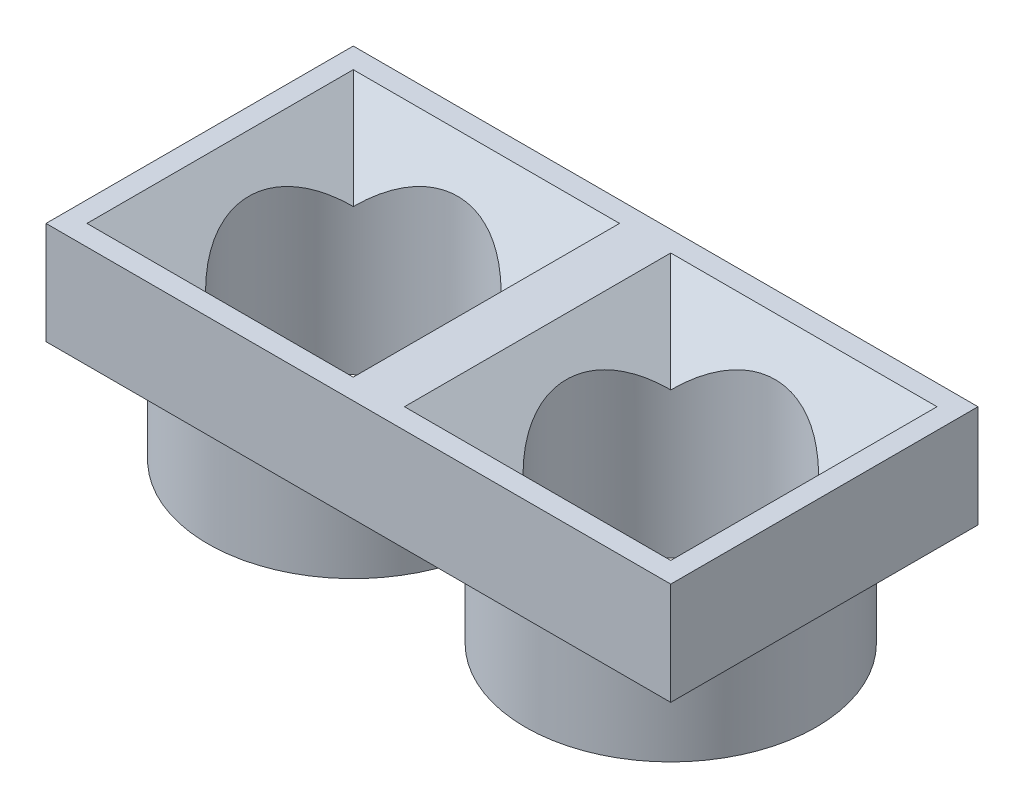
ISO-10303-21;
HEADER;
FILE_DESCRIPTION(('STEP AP214'),'2;1');
FILE_NAME('part.step','',(''),(''),'','','');
FILE_SCHEMA(('AUTOMOTIVE_DESIGN { 1 0 10303 214 1 1 1 1 }'));
ENDSEC;
DATA;
#1=APPLICATION_CONTEXT('core data for automotive mechanical design processes');
#2=APPLICATION_PROTOCOL_DEFINITION('international standard','automotive_design',2000,#1);
#3=PRODUCT_CONTEXT('',#1,'mechanical');
#4=PRODUCT('Part','Part','',(#3));
#5=PRODUCT_RELATED_PRODUCT_CATEGORY('part','',(#4));
#6=PRODUCT_DEFINITION_FORMATION('','',#4);
#7=PRODUCT_DEFINITION_CONTEXT('part definition',#1,'design');
#8=PRODUCT_DEFINITION('design','',#6,#7);
#9=PRODUCT_DEFINITION_SHAPE('','',#8);
#10=(LENGTH_UNIT() NAMED_UNIT(*) SI_UNIT(.MILLI.,.METRE.));
#11=(NAMED_UNIT(*) PLANE_ANGLE_UNIT() SI_UNIT($,.RADIAN.));
#12=(NAMED_UNIT(*) SI_UNIT($,.STERADIAN.) SOLID_ANGLE_UNIT());
#13=UNCERTAINTY_MEASURE_WITH_UNIT(LENGTH_MEASURE(1.E-05),#10,'distance_accuracy_value','');
#14=(GEOMETRIC_REPRESENTATION_CONTEXT(3) GLOBAL_UNCERTAINTY_ASSIGNED_CONTEXT((#13)) GLOBAL_UNIT_ASSIGNED_CONTEXT((#10,
#11,#12)) REPRESENTATION_CONTEXT('',''));
#15=CARTESIAN_POINT('',(0.,0.,0.));
#16=DIRECTION('',(0.,0.,1.));
#17=DIRECTION('',(1.,0.,0.));
#18=AXIS2_PLACEMENT_3D('',#15,#16,#17);
#19=CARTESIAN_POINT('',(0.,0.,0.));
#20=DIRECTION('',(0.,1.,0.));
#21=DIRECTION('',(0.,0.,1.));
#22=AXIS2_PLACEMENT_3D('',#19,#20,#21);
#23=PLANE('',#22);
#24=DIRECTION('',(0.,0.,-1.));
#25=VECTOR('',#24,1.);
#26=CARTESIAN_POINT('',(15.25,0.,-7.5));
#27=LINE('',#26,#25);
#28=CARTESIAN_POINT('',(15.25,0.,7.5));
#29=VERTEX_POINT('',#28);
#30=CARTESIAN_POINT('',(15.25,0.,-7.5));
#31=VERTEX_POINT('',#30);
#32=EDGE_CURVE('E214',#29,#31,#27,.T.);
#33=ORIENTED_EDGE('',*,*,#32,.F.);
#34=DIRECTION('',(1.,0.,0.));
#35=VECTOR('',#34,1.);
#36=CARTESIAN_POINT('',(-15.25,0.,7.5));
#37=LINE('',#36,#35);
#38=CARTESIAN_POINT('',(-15.25,0.,7.5));
#39=VERTEX_POINT('',#38);
#40=EDGE_CURVE('E233',#39,#29,#37,.T.);
#41=ORIENTED_EDGE('',*,*,#40,.F.);
#42=DIRECTION('',(0.,0.,1.));
#43=VECTOR('',#42,1.);
#44=CARTESIAN_POINT('',(-15.25,0.,-7.5));
#45=LINE('',#44,#43);
#46=CARTESIAN_POINT('',(-15.25,0.,-7.5));
#47=VERTEX_POINT('',#46);
#48=EDGE_CURVE('E249',#47,#39,#45,.T.);
#49=ORIENTED_EDGE('',*,*,#48,.F.);
#50=DIRECTION('',(-1.,0.,0.));
#51=VECTOR('',#50,1.);
#52=CARTESIAN_POINT('',(-15.25,0.,-7.5));
#53=LINE('',#52,#51);
#54=EDGE_CURVE('E246',#31,#47,#53,.T.);
#55=ORIENTED_EDGE('',*,*,#54,.F.);
#56=EDGE_LOOP('',(#33,#41,#49,#55));
#57=FACE_BOUND('',#56,.T.);
#58=CARTESIAN_POINT('',(-7.75,0.,0.));
#59=DIRECTION('',(0.,-1.,0.));
#60=DIRECTION('',(0.,0.,-1.));
#61=AXIS2_PLACEMENT_3D('',#58,#59,#60);
#62=CIRCLE('',#61,7.1);
#63=CARTESIAN_POINT('',(-7.75,0.,-7.1));
#64=VERTEX_POINT('',#63);
#65=EDGE_CURVE('E51',#64,#64,#62,.T.);
#66=ORIENTED_EDGE('',*,*,#65,.F.);
#67=EDGE_LOOP('',(#66));
#68=FACE_BOUND('',#67,.T.);
#69=CARTESIAN_POINT('',(7.75,0.,0.));
#70=DIRECTION('',(0.,1.,0.));
#71=DIRECTION('',(0.,0.,1.));
#72=AXIS2_PLACEMENT_3D('',#69,#70,#71);
#73=CIRCLE('',#72,7.1);
#74=CARTESIAN_POINT('',(7.75,0.,7.1));
#75=VERTEX_POINT('',#74);
#76=EDGE_CURVE('E11',#75,#75,#73,.F.);
#77=ORIENTED_EDGE('',*,*,#76,.F.);
#78=EDGE_LOOP('',(#77));
#79=FACE_BOUND('',#78,.T.);
#80=ADVANCED_FACE('F41',(#57,#68,#79),#23,.F.);
#81=CARTESIAN_POINT('',(15.25,5.,-7.5));
#82=DIRECTION('',(-1.,0.,0.));
#83=DIRECTION('',(0.,0.,1.));
#84=AXIS2_PLACEMENT_3D('',#81,#82,#83);
#85=PLANE('',#84);
#86=ORIENTED_EDGE('',*,*,#32,.T.);
#87=DIRECTION('',(0.,-1.,0.));
#88=VECTOR('',#87,1.);
#89=CARTESIAN_POINT('',(15.25,5.,-7.5));
#90=LINE('',#89,#88);
#91=CARTESIAN_POINT('',(15.25,5.,-7.5));
#92=VERTEX_POINT('',#91);
#93=EDGE_CURVE('E140',#92,#31,#90,.T.);
#94=ORIENTED_EDGE('',*,*,#93,.F.);
#95=DIRECTION('',(0.,0.,-1.));
#96=VECTOR('',#95,1.);
#97=CARTESIAN_POINT('',(15.25,5.,-7.5));
#98=LINE('',#97,#96);
#99=CARTESIAN_POINT('',(15.25,5.,7.5));
#100=VERTEX_POINT('',#99);
#101=EDGE_CURVE('E228',#100,#92,#98,.T.);
#102=ORIENTED_EDGE('',*,*,#101,.F.);
#103=DIRECTION('',(0.,-1.,0.));
#104=VECTOR('',#103,1.);
#105=CARTESIAN_POINT('',(15.25,5.,7.5));
#106=LINE('',#105,#104);
#107=EDGE_CURVE('E242',#100,#29,#106,.T.);
#108=ORIENTED_EDGE('',*,*,#107,.T.);
#109=EDGE_LOOP('',(#86,#94,#102,#108));
#110=FACE_BOUND('',#109,.T.);
#111=ADVANCED_FACE('F303',(#110),#85,.F.);
#112=CARTESIAN_POINT('',(-15.25,5.,-7.5));
#113=DIRECTION('',(0.,0.,1.));
#114=DIRECTION('',(1.,0.,0.));
#115=AXIS2_PLACEMENT_3D('',#112,#113,#114);
#116=PLANE('',#115);
#117=ORIENTED_EDGE('',*,*,#54,.T.);
#118=DIRECTION('',(0.,-1.,0.));
#119=VECTOR('',#118,1.);
#120=CARTESIAN_POINT('',(-15.25,5.,-7.5));
#121=LINE('',#120,#119);
#122=CARTESIAN_POINT('',(-15.25,5.,-7.5));
#123=VERTEX_POINT('',#122);
#124=EDGE_CURVE('E261',#123,#47,#121,.T.);
#125=ORIENTED_EDGE('',*,*,#124,.F.);
#126=DIRECTION('',(-1.,0.,0.));
#127=VECTOR('',#126,1.);
#128=CARTESIAN_POINT('',(-15.25,5.,-7.5));
#129=LINE('',#128,#127);
#130=EDGE_CURVE('E232',#92,#123,#129,.T.);
#131=ORIENTED_EDGE('',*,*,#130,.F.);
#132=ORIENTED_EDGE('',*,*,#93,.T.);
#133=EDGE_LOOP('',(#117,#125,#131,#132));
#134=FACE_BOUND('',#133,.T.);
#135=ADVANCED_FACE('F309',(#134),#116,.F.);
#136=CARTESIAN_POINT('',(-15.25,5.,-7.5));
#137=DIRECTION('',(1.,0.,0.));
#138=DIRECTION('',(0.,0.,-1.));
#139=AXIS2_PLACEMENT_3D('',#136,#137,#138);
#140=PLANE('',#139);
#141=ORIENTED_EDGE('',*,*,#48,.T.);
#142=DIRECTION('',(0.,-1.,0.));
#143=VECTOR('',#142,1.);
#144=CARTESIAN_POINT('',(-15.25,5.,7.5));
#145=LINE('',#144,#143);
#146=CARTESIAN_POINT('',(-15.25,5.,7.5));
#147=VERTEX_POINT('',#146);
#148=EDGE_CURVE('E257',#147,#39,#145,.T.);
#149=ORIENTED_EDGE('',*,*,#148,.F.);
#150=DIRECTION('',(0.,0.,1.));
#151=VECTOR('',#150,1.);
#152=CARTESIAN_POINT('',(-15.25,5.,-7.5));
#153=LINE('',#152,#151);
#154=EDGE_CURVE('E236',#123,#147,#153,.T.);
#155=ORIENTED_EDGE('',*,*,#154,.F.);
#156=ORIENTED_EDGE('',*,*,#124,.T.);
#157=EDGE_LOOP('',(#141,#149,#155,#156));
#158=FACE_BOUND('',#157,.T.);
#159=ADVANCED_FACE('F319',(#158),#140,.F.);
#160=CARTESIAN_POINT('',(-15.25,5.,7.5));
#161=DIRECTION('',(0.,0.,-1.));
#162=DIRECTION('',(-1.,0.,0.));
#163=AXIS2_PLACEMENT_3D('',#160,#161,#162);
#164=PLANE('',#163);
#165=ORIENTED_EDGE('',*,*,#40,.T.);
#166=ORIENTED_EDGE('',*,*,#107,.F.);
#167=DIRECTION('',(1.,0.,0.));
#168=VECTOR('',#167,1.);
#169=CARTESIAN_POINT('',(-15.25,5.,7.5));
#170=LINE('',#169,#168);
#171=EDGE_CURVE('E239',#147,#100,#170,.T.);
#172=ORIENTED_EDGE('',*,*,#171,.F.);
#173=ORIENTED_EDGE('',*,*,#148,.T.);
#174=EDGE_LOOP('',(#165,#166,#172,#173));
#175=FACE_BOUND('',#174,.T.);
#176=ADVANCED_FACE('F316',(#175),#164,.F.);
#177=CARTESIAN_POINT('',(0.,5.,0.));
#178=DIRECTION('',(0.,1.,0.));
#179=DIRECTION('',(0.,0.,1.));
#180=AXIS2_PLACEMENT_3D('',#177,#178,#179);
#181=PLANE('',#180);
#182=DIRECTION('',(0.,0.,1.));
#183=VECTOR('',#182,1.);
#184=CARTESIAN_POINT('',(-14.25,5.,-6.5));
#185=LINE('',#184,#183);
#186=CARTESIAN_POINT('',(-14.25,5.,-6.5));
#187=VERTEX_POINT('',#186);
#188=CARTESIAN_POINT('',(-14.25,5.,6.5));
#189=VERTEX_POINT('',#188);
#190=EDGE_CURVE('E198',#187,#189,#185,.T.);
#191=ORIENTED_EDGE('',*,*,#190,.F.);
#192=DIRECTION('',(-1.,0.,0.));
#193=VECTOR('',#192,1.);
#194=CARTESIAN_POINT('',(-14.25,5.,-6.5));
#195=LINE('',#194,#193);
#196=CARTESIAN_POINT('',(-1.25,5.,-6.5));
#197=VERTEX_POINT('',#196);
#198=EDGE_CURVE('E210',#197,#187,#195,.T.);
#199=ORIENTED_EDGE('',*,*,#198,.F.);
#200=DIRECTION('',(0.,0.,-1.));
#201=VECTOR('',#200,1.);
#202=CARTESIAN_POINT('',(-1.25,5.,-6.5));
#203=LINE('',#202,#201);
#204=CARTESIAN_POINT('',(-1.25,5.,6.5));
#205=VERTEX_POINT('',#204);
#206=EDGE_CURVE('E206',#205,#197,#203,.T.);
#207=ORIENTED_EDGE('',*,*,#206,.F.);
#208=DIRECTION('',(1.,0.,0.));
#209=VECTOR('',#208,1.);
#210=CARTESIAN_POINT('',(-14.25,5.,6.5));
#211=LINE('',#210,#209);
#212=EDGE_CURVE('E202',#189,#205,#211,.T.);
#213=ORIENTED_EDGE('',*,*,#212,.F.);
#214=EDGE_LOOP('',(#191,#199,#207,#213));
#215=FACE_BOUND('',#214,.T.);
#216=DIRECTION('',(0.,0.,1.));
#217=VECTOR('',#216,1.);
#218=CARTESIAN_POINT('',(1.25,5.,-6.5));
#219=LINE('',#218,#217);
#220=CARTESIAN_POINT('',(1.25,5.,-6.5));
#221=VERTEX_POINT('',#220);
#222=CARTESIAN_POINT('',(1.25,5.,6.5));
#223=VERTEX_POINT('',#222);
#224=EDGE_CURVE('E215',#221,#223,#219,.T.);
#225=ORIENTED_EDGE('',*,*,#224,.F.);
#226=DIRECTION('',(-1.,0.,0.));
#227=VECTOR('',#226,1.);
#228=CARTESIAN_POINT('',(1.25,5.,-6.5));
#229=LINE('',#228,#227);
#230=CARTESIAN_POINT('',(14.25,5.,-6.5));
#231=VERTEX_POINT('',#230);
#232=EDGE_CURVE('E156',#231,#221,#229,.T.);
#233=ORIENTED_EDGE('',*,*,#232,.F.);
#234=DIRECTION('',(0.,0.,-1.));
#235=VECTOR('',#234,1.);
#236=CARTESIAN_POINT('',(14.25,5.,-6.5));
#237=LINE('',#236,#235);
#238=CARTESIAN_POINT('',(14.25,5.,6.5));
#239=VERTEX_POINT('',#238);
#240=EDGE_CURVE('E222',#239,#231,#237,.T.);
#241=ORIENTED_EDGE('',*,*,#240,.F.);
#242=DIRECTION('',(1.,0.,0.));
#243=VECTOR('',#242,1.);
#244=CARTESIAN_POINT('',(1.25,5.,6.5));
#245=LINE('',#244,#243);
#246=EDGE_CURVE('E218',#223,#239,#245,.T.);
#247=ORIENTED_EDGE('',*,*,#246,.F.);
#248=EDGE_LOOP('',(#225,#233,#241,#247));
#249=FACE_BOUND('',#248,.T.);
#250=ORIENTED_EDGE('',*,*,#101,.T.);
#251=ORIENTED_EDGE('',*,*,#130,.T.);
#252=ORIENTED_EDGE('',*,*,#154,.T.);
#253=ORIENTED_EDGE('',*,*,#171,.T.);
#254=EDGE_LOOP('',(#250,#251,#252,#253));
#255=FACE_BOUND('',#254,.T.);
#256=ADVANCED_FACE('F285',(#215,#249,#255),#181,.T.);
#257=CARTESIAN_POINT('',(0.,2.,3.49999999999998));
#258=DIRECTION('',(0.,-0.707106781186551,0.707106781186544));
#259=DIRECTION('',(1.,0.,0.));
#260=AXIS2_PLACEMENT_3D('',#257,#258,#259);
#261=PLANE('',#260);
#262=DIRECTION('',(-0.577350269189628,-0.577350269189622,-0.577350269189628));
#263=VECTOR('',#262,1.);
#264=CARTESIAN_POINT('',(-5.41666666666669,0.833333333333345,2.33333333333331));
#265=LINE('',#264,#263);
#266=CARTESIAN_POINT('',(-4.14375541594861,2.10624458405141,3.60624458405139));
#267=VERTEX_POINT('',#266);
#268=EDGE_CURVE('E167',#267,#205,#265,.F.);
#269=ORIENTED_EDGE('',*,*,#268,.F.);
#270=CARTESIAN_POINT('',(-7.75,-1.49999999999994,0.));
#271=DIRECTION('',(0.,-0.707106781186551,0.707106781186544));
#272=DIRECTION('',(0.,0.707106781186544,0.707106781186551));
#273=AXIS2_PLACEMENT_3D('',#270,#271,#272);
#274=ELLIPSE('',#273,7.21248916810275,5.1);
#275=CARTESIAN_POINT('',(-11.3562445840514,2.10624458405141,3.60624458405139));
#276=VERTEX_POINT('',#275);
#277=EDGE_CURVE('E159',#267,#276,#274,.T.);
#278=ORIENTED_EDGE('',*,*,#277,.T.);
#279=DIRECTION('',(0.577350269189628,-0.577350269189622,-0.577350269189628));
#280=VECTOR('',#279,1.);
#281=CARTESIAN_POINT('',(-7.49999999999996,-1.74999999999998,-0.250000000000041));
#282=LINE('',#281,#280);
#283=EDGE_CURVE('E272',#189,#276,#282,.T.);
#284=ORIENTED_EDGE('',*,*,#283,.F.);
#285=ORIENTED_EDGE('',*,*,#212,.T.);
#286=EDGE_LOOP('',(#269,#278,#284,#285));
#287=FACE_BOUND('',#286,.T.);
#288=ADVANCED_FACE('F287',(#287),#261,.F.);
#289=CARTESIAN_POINT('',(-4.25000000000002,2.,0.));
#290=DIRECTION('',(0.707106781186544,-0.707106781186551,0.));
#291=DIRECTION('',(0.,0.,-1.));
#292=AXIS2_PLACEMENT_3D('',#289,#290,#291);
#293=PLANE('',#292);
#294=DIRECTION('',(-0.577350269189628,-0.577350269189622,0.577350269189628));
#295=VECTOR('',#294,1.);
#296=CARTESIAN_POINT('',(-2.83333333333334,3.41666666666667,-4.91666666666666));
#297=LINE('',#296,#295);
#298=CARTESIAN_POINT('',(-4.14375541594861,2.10624458405141,-3.60624458405139));
#299=VERTEX_POINT('',#298);
#300=EDGE_CURVE('E270',#299,#197,#297,.F.);
#301=ORIENTED_EDGE('',*,*,#300,.F.);
#302=CARTESIAN_POINT('',(-7.75,-1.49999999999995,0.));
#303=DIRECTION('',(0.707106781186544,-0.707106781186551,0.));
#304=DIRECTION('',(0.707106781186551,0.707106781186544,0.));
#305=AXIS2_PLACEMENT_3D('',#302,#303,#304);
#306=ELLIPSE('',#305,7.21248916810275,5.1);
#307=EDGE_CURVE('E58',#299,#267,#306,.T.);
#308=ORIENTED_EDGE('',*,*,#307,.T.);
#309=ORIENTED_EDGE('',*,*,#268,.T.);
#310=ORIENTED_EDGE('',*,*,#206,.T.);
#311=EDGE_LOOP('',(#301,#308,#309,#310));
#312=FACE_BOUND('',#311,.T.);
#313=ADVANCED_FACE('F281',(#312),#293,.F.);
#314=CARTESIAN_POINT('',(-11.25,2.,0.));
#315=DIRECTION('',(-0.707106781186544,-0.707106781186551,0.));
#316=DIRECTION('',(0.,0.,1.));
#317=AXIS2_PLACEMENT_3D('',#314,#315,#316);
#318=PLANE('',#317);
#319=ORIENTED_EDGE('',*,*,#283,.T.);
#320=CARTESIAN_POINT('',(-7.75,-1.49999999999994,0.));
#321=DIRECTION('',(-0.707106781186544,-0.707106781186551,0.));
#322=DIRECTION('',(-0.707106781186551,0.707106781186544,0.));
#323=AXIS2_PLACEMENT_3D('',#320,#321,#322);
#324=ELLIPSE('',#323,7.21248916810275,5.1);
#325=CARTESIAN_POINT('',(-11.3562445840514,2.10624458405141,-3.60624458405139));
#326=VERTEX_POINT('',#325);
#327=EDGE_CURVE('E192',#276,#326,#324,.T.);
#328=ORIENTED_EDGE('',*,*,#327,.T.);
#329=DIRECTION('',(-0.577350269189628,0.577350269189622,-0.577350269189628));
#330=VECTOR('',#329,1.);
#331=CARTESIAN_POINT('',(-7.49999999999996,-1.74999999999998,0.25000000000004));
#332=LINE('',#331,#330);
#333=EDGE_CURVE('E174',#187,#326,#332,.F.);
#334=ORIENTED_EDGE('',*,*,#333,.F.);
#335=ORIENTED_EDGE('',*,*,#190,.T.);
#336=EDGE_LOOP('',(#319,#328,#334,#335));
#337=FACE_BOUND('',#336,.T.);
#338=ADVANCED_FACE('F289',(#337),#318,.F.);
#339=CARTESIAN_POINT('',(0.,2.,-3.49999999999998));
#340=DIRECTION('',(0.,-0.707106781186551,-0.707106781186544));
#341=DIRECTION('',(-1.,0.,0.));
#342=AXIS2_PLACEMENT_3D('',#339,#340,#341);
#343=PLANE('',#342);
#344=ORIENTED_EDGE('',*,*,#333,.T.);
#345=CARTESIAN_POINT('',(-7.75,-1.49999999999994,0.));
#346=DIRECTION('',(0.,-0.707106781186551,-0.707106781186544));
#347=DIRECTION('',(0.,0.707106781186544,-0.707106781186551));
#348=AXIS2_PLACEMENT_3D('',#345,#346,#347);
#349=ELLIPSE('',#348,7.21248916810275,5.1);
#350=EDGE_CURVE('E139',#326,#299,#349,.T.);
#351=ORIENTED_EDGE('',*,*,#350,.T.);
#352=ORIENTED_EDGE('',*,*,#300,.T.);
#353=ORIENTED_EDGE('',*,*,#198,.T.);
#354=EDGE_LOOP('',(#344,#351,#352,#353));
#355=FACE_BOUND('',#354,.T.);
#356=ADVANCED_FACE('F290',(#355),#343,.F.);
#357=CARTESIAN_POINT('',(0.,2.,3.49999999999997));
#358=DIRECTION('',(0.,-0.707106781186551,0.707106781186544));
#359=DIRECTION('',(1.,0.,0.));
#360=AXIS2_PLACEMENT_3D('',#357,#358,#359);
#361=PLANE('',#360);
#362=DIRECTION('',(-0.577350269189628,-0.577350269189622,-0.577350269189628));
#363=VECTOR('',#362,1.);
#364=CARTESIAN_POINT('',(10.0833333333333,0.833333333333348,2.3333333333333));
#365=LINE('',#364,#363);
#366=CARTESIAN_POINT('',(11.3562445840514,2.10624458405142,3.60624458405139));
#367=VERTEX_POINT('',#366);
#368=EDGE_CURVE('E172',#367,#239,#365,.F.);
#369=ORIENTED_EDGE('',*,*,#368,.F.);
#370=CARTESIAN_POINT('',(7.75,-1.49999999999993,0.));
#371=DIRECTION('',(0.,-0.707106781186551,0.707106781186544));
#372=DIRECTION('',(0.,0.707106781186544,0.707106781186551));
#373=AXIS2_PLACEMENT_3D('',#370,#371,#372);
#374=ELLIPSE('',#373,7.21248916810275,5.1);
#375=CARTESIAN_POINT('',(4.14375541594861,2.10624458405143,3.60624458405139));
#376=VERTEX_POINT('',#375);
#377=EDGE_CURVE('E189',#367,#376,#374,.T.);
#378=ORIENTED_EDGE('',*,*,#377,.T.);
#379=DIRECTION('',(0.577350269189628,-0.577350269189622,-0.577350269189628));
#380=VECTOR('',#379,1.);
#381=CARTESIAN_POINT('',(2.83333333333335,3.41666666666667,4.91666666666666));
#382=LINE('',#381,#380);
#383=EDGE_CURVE('E149',#223,#376,#382,.T.);
#384=ORIENTED_EDGE('',*,*,#383,.F.);
#385=ORIENTED_EDGE('',*,*,#246,.T.);
#386=EDGE_LOOP('',(#369,#378,#384,#385));
#387=FACE_BOUND('',#386,.T.);
#388=ADVANCED_FACE('F44',(#387),#361,.F.);
#389=CARTESIAN_POINT('',(11.25,2.,0.));
#390=DIRECTION('',(0.707106781186544,-0.707106781186551,0.));
#391=DIRECTION('',(0.,0.,-1.));
#392=AXIS2_PLACEMENT_3D('',#389,#390,#391);
#393=PLANE('',#392);
#394=DIRECTION('',(-0.577350269189628,-0.577350269189622,0.577350269189628));
#395=VECTOR('',#394,1.);
#396=CARTESIAN_POINT('',(7.49999999999995,-1.74999999999998,0.250000000000048));
#397=LINE('',#396,#395);
#398=CARTESIAN_POINT('',(11.3562445840514,2.10624458405142,-3.60624458405139));
#399=VERTEX_POINT('',#398);
#400=EDGE_CURVE('E158',#399,#231,#397,.F.);
#401=ORIENTED_EDGE('',*,*,#400,.F.);
#402=CARTESIAN_POINT('',(7.75,-1.49999999999993,0.));
#403=DIRECTION('',(0.707106781186544,-0.707106781186551,0.));
#404=DIRECTION('',(0.707106781186551,0.707106781186544,0.));
#405=AXIS2_PLACEMENT_3D('',#402,#403,#404);
#406=ELLIPSE('',#405,7.21248916810275,5.1);
#407=EDGE_CURVE('E66',#399,#367,#406,.T.);
#408=ORIENTED_EDGE('',*,*,#407,.T.);
#409=ORIENTED_EDGE('',*,*,#368,.T.);
#410=ORIENTED_EDGE('',*,*,#240,.T.);
#411=EDGE_LOOP('',(#401,#408,#409,#410));
#412=FACE_BOUND('',#411,.T.);
#413=ADVANCED_FACE('F297',(#412),#393,.F.);
#414=CARTESIAN_POINT('',(4.25000000000003,2.,0.));
#415=DIRECTION('',(-0.707106781186544,-0.707106781186551,0.));
#416=DIRECTION('',(0.,0.,1.));
#417=AXIS2_PLACEMENT_3D('',#414,#415,#416);
#418=PLANE('',#417);
#419=ORIENTED_EDGE('',*,*,#383,.T.);
#420=CARTESIAN_POINT('',(7.75,-1.49999999999993,0.));
#421=DIRECTION('',(-0.707106781186544,-0.707106781186551,0.));
#422=DIRECTION('',(-0.707106781186551,0.707106781186544,0.));
#423=AXIS2_PLACEMENT_3D('',#420,#421,#422);
#424=ELLIPSE('',#423,7.21248916810275,5.1);
#425=CARTESIAN_POINT('',(4.14375541594861,2.10624458405142,-3.60624458405139));
#426=VERTEX_POINT('',#425);
#427=EDGE_CURVE('E133',#376,#426,#424,.T.);
#428=ORIENTED_EDGE('',*,*,#427,.T.);
#429=DIRECTION('',(-0.577350269189628,0.577350269189622,-0.577350269189628));
#430=VECTOR('',#429,1.);
#431=CARTESIAN_POINT('',(2.83333333333335,3.41666666666667,-4.91666666666666));
#432=LINE('',#431,#430);
#433=EDGE_CURVE('E147',#221,#426,#432,.F.);
#434=ORIENTED_EDGE('',*,*,#433,.F.);
#435=ORIENTED_EDGE('',*,*,#224,.T.);
#436=EDGE_LOOP('',(#419,#428,#434,#435));
#437=FACE_BOUND('',#436,.T.);
#438=ADVANCED_FACE('F145',(#437),#418,.F.);
#439=CARTESIAN_POINT('',(0.,2.,-3.49999999999997));
#440=DIRECTION('',(0.,-0.707106781186551,-0.707106781186544));
#441=DIRECTION('',(-1.,0.,0.));
#442=AXIS2_PLACEMENT_3D('',#439,#440,#441);
#443=PLANE('',#442);
#444=ORIENTED_EDGE('',*,*,#433,.T.);
#445=CARTESIAN_POINT('',(7.75,-1.49999999999993,0.));
#446=DIRECTION('',(0.,-0.707106781186551,-0.707106781186544));
#447=DIRECTION('',(0.,0.707106781186544,-0.707106781186551));
#448=AXIS2_PLACEMENT_3D('',#445,#446,#447);
#449=ELLIPSE('',#448,7.21248916810275,5.1);
#450=EDGE_CURVE('E129',#426,#399,#449,.T.);
#451=ORIENTED_EDGE('',*,*,#450,.T.);
#452=ORIENTED_EDGE('',*,*,#400,.T.);
#453=ORIENTED_EDGE('',*,*,#232,.T.);
#454=EDGE_LOOP('',(#444,#451,#452,#453));
#455=FACE_BOUND('',#454,.T.);
#456=ADVANCED_FACE('F154',(#455),#443,.F.);
#457=CARTESIAN_POINT('',(7.75,0.,0.));
#458=DIRECTION('',(0.,1.,0.));
#459=DIRECTION('',(0.,0.,1.));
#460=AXIS2_PLACEMENT_3D('',#457,#458,#459);
#461=CYLINDRICAL_SURFACE('',#460,5.1);
#462=ORIENTED_EDGE('',*,*,#407,.F.);
#463=ORIENTED_EDGE('',*,*,#450,.F.);
#464=ORIENTED_EDGE('',*,*,#427,.F.);
#465=ORIENTED_EDGE('',*,*,#377,.F.);
#466=EDGE_LOOP('',(#462,#463,#464,#465));
#467=FACE_BOUND('',#466,.T.);
#468=CARTESIAN_POINT('',(7.75,-5.,0.));
#469=DIRECTION('',(0.,-1.,0.));
#470=DIRECTION('',(0.,0.,-1.));
#471=AXIS2_PLACEMENT_3D('',#468,#469,#470);
#472=CIRCLE('',#471,5.1);
#473=CARTESIAN_POINT('',(7.75,-5.,-5.1));
#474=VERTEX_POINT('',#473);
#475=EDGE_CURVE('E512',#474,#474,#472,.T.);
#476=ORIENTED_EDGE('',*,*,#475,.T.);
#477=EDGE_LOOP('',(#476));
#478=FACE_BOUND('',#477,.T.);
#479=ADVANCED_FACE('F131',(#467,#478),#461,.F.);
#480=CARTESIAN_POINT('',(-7.75,0.,0.));
#481=DIRECTION('',(0.,1.,0.));
#482=DIRECTION('',(0.,0.,1.));
#483=AXIS2_PLACEMENT_3D('',#480,#481,#482);
#484=CYLINDRICAL_SURFACE('',#483,5.1);
#485=ORIENTED_EDGE('',*,*,#307,.F.);
#486=ORIENTED_EDGE('',*,*,#350,.F.);
#487=ORIENTED_EDGE('',*,*,#327,.F.);
#488=ORIENTED_EDGE('',*,*,#277,.F.);
#489=EDGE_LOOP('',(#485,#486,#487,#488));
#490=FACE_BOUND('',#489,.T.);
#491=CARTESIAN_POINT('',(-7.75,-5.,0.));
#492=DIRECTION('',(0.,-1.,0.));
#493=DIRECTION('',(0.,0.,-1.));
#494=AXIS2_PLACEMENT_3D('',#491,#492,#493);
#495=CIRCLE('',#494,5.1);
#496=CARTESIAN_POINT('',(-7.75,-5.,-5.1));
#497=VERTEX_POINT('',#496);
#498=EDGE_CURVE('E511',#497,#497,#495,.T.);
#499=ORIENTED_EDGE('',*,*,#498,.T.);
#500=EDGE_LOOP('',(#499));
#501=FACE_BOUND('',#500,.T.);
#502=ADVANCED_FACE('F386',(#490,#501),#484,.F.);
#503=CARTESIAN_POINT('',(-7.75,-5.,0.));
#504=DIRECTION('',(0.,-1.,0.));
#505=DIRECTION('',(0.,0.,-1.));
#506=AXIS2_PLACEMENT_3D('',#503,#504,#505);
#507=PLANE('',#506);
#508=CARTESIAN_POINT('',(-7.75,-5.,0.));
#509=DIRECTION('',(0.,-1.,0.));
#510=DIRECTION('',(0.,0.,-1.));
#511=AXIS2_PLACEMENT_3D('',#508,#509,#510);
#512=CIRCLE('',#511,7.1);
#513=CARTESIAN_POINT('',(-7.75,-5.,-7.1));
#514=VERTEX_POINT('',#513);
#515=EDGE_CURVE('E151',#514,#514,#512,.T.);
#516=ORIENTED_EDGE('',*,*,#515,.T.);
#517=EDGE_LOOP('',(#516));
#518=FACE_BOUND('',#517,.T.);
#519=ORIENTED_EDGE('',*,*,#498,.F.);
#520=EDGE_LOOP('',(#519));
#521=FACE_BOUND('',#520,.T.);
#522=ADVANCED_FACE('F392',(#518,#521),#507,.T.);
#523=CARTESIAN_POINT('',(-7.75,-5.,0.));
#524=DIRECTION('',(0.,1.,0.));
#525=DIRECTION('',(0.,0.,1.));
#526=AXIS2_PLACEMENT_3D('',#523,#524,#525);
#527=CYLINDRICAL_SURFACE('',#526,7.1);
#528=ORIENTED_EDGE('',*,*,#515,.F.);
#529=EDGE_LOOP('',(#528));
#530=FACE_BOUND('',#529,.T.);
#531=ORIENTED_EDGE('',*,*,#65,.T.);
#532=EDGE_LOOP('',(#531));
#533=FACE_BOUND('',#532,.T.);
#534=ADVANCED_FACE('F399',(#530,#533),#527,.T.);
#535=CARTESIAN_POINT('',(7.75,-5.,0.));
#536=DIRECTION('',(0.,-1.,0.));
#537=DIRECTION('',(0.,0.,-1.));
#538=AXIS2_PLACEMENT_3D('',#535,#536,#537);
#539=PLANE('',#538);
#540=CARTESIAN_POINT('',(7.75,-5.,0.));
#541=DIRECTION('',(0.,-1.,0.));
#542=DIRECTION('',(0.,0.,-1.));
#543=AXIS2_PLACEMENT_3D('',#540,#541,#542);
#544=CIRCLE('',#543,7.1);
#545=CARTESIAN_POINT('',(7.75,-5.,-7.1));
#546=VERTEX_POINT('',#545);
#547=EDGE_CURVE('E507',#546,#546,#544,.T.);
#548=ORIENTED_EDGE('',*,*,#547,.T.);
#549=EDGE_LOOP('',(#548));
#550=FACE_BOUND('',#549,.T.);
#551=ORIENTED_EDGE('',*,*,#475,.F.);
#552=EDGE_LOOP('',(#551));
#553=FACE_BOUND('',#552,.T.);
#554=ADVANCED_FACE('F407',(#550,#553),#539,.T.);
#555=CARTESIAN_POINT('',(7.75,-5.,0.));
#556=DIRECTION('',(0.,1.,0.));
#557=DIRECTION('',(0.,0.,1.));
#558=AXIS2_PLACEMENT_3D('',#555,#556,#557);
#559=CYLINDRICAL_SURFACE('',#558,7.1);
#560=ORIENTED_EDGE('',*,*,#547,.F.);
#561=EDGE_LOOP('',(#560));
#562=FACE_BOUND('',#561,.T.);
#563=ORIENTED_EDGE('',*,*,#76,.T.);
#564=EDGE_LOOP('',(#563));
#565=FACE_BOUND('',#564,.T.);
#566=ADVANCED_FACE('F415',(#562,#565),#559,.T.);
#567=CLOSED_SHELL('',(#80,#111,#135,#159,#176,#256,#288,#313,#338,#356,#388,#413,#438,#456,#479,
#502,#522,#534,#554,#566));
#568=MANIFOLD_SOLID_BREP('B2',#567);
#569=ADVANCED_BREP_SHAPE_REPRESENTATION('',(#18,#568),#14);
#570=SHAPE_DEFINITION_REPRESENTATION(#9,#569);
ENDSEC;
END-ISO-10303-21;
